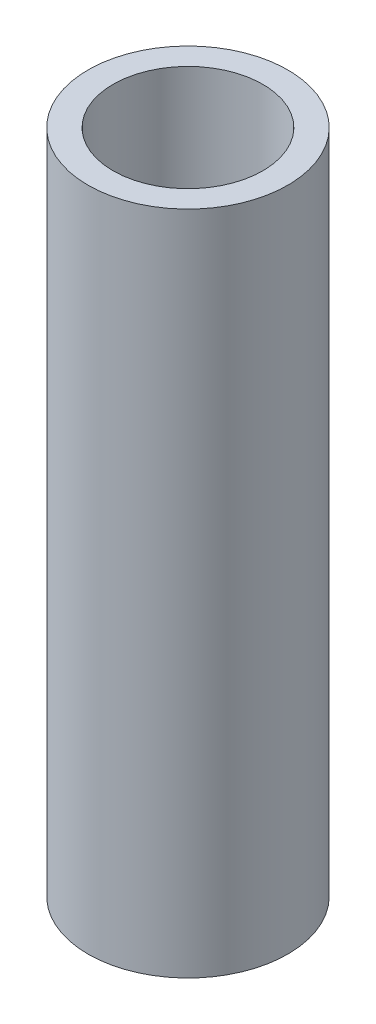
ISO-10303-21;
HEADER;
FILE_DESCRIPTION(('STEP AP214'),'2;1');
FILE_NAME('part.step','',(''),(''),'','','');
FILE_SCHEMA(('AUTOMOTIVE_DESIGN { 1 0 10303 214 1 1 1 1 }'));
ENDSEC;
DATA;
#1=APPLICATION_CONTEXT('core data for automotive mechanical design processes');
#2=APPLICATION_PROTOCOL_DEFINITION('international standard','automotive_design',2000,#1);
#3=PRODUCT_CONTEXT('',#1,'mechanical');
#4=PRODUCT('Part','Part','',(#3));
#5=PRODUCT_RELATED_PRODUCT_CATEGORY('part','',(#4));
#6=PRODUCT_DEFINITION_FORMATION('','',#4);
#7=PRODUCT_DEFINITION_CONTEXT('part definition',#1,'design');
#8=PRODUCT_DEFINITION('design','',#6,#7);
#9=PRODUCT_DEFINITION_SHAPE('','',#8);
#10=(LENGTH_UNIT() NAMED_UNIT(*) SI_UNIT(.MILLI.,.METRE.));
#11=(NAMED_UNIT(*) PLANE_ANGLE_UNIT() SI_UNIT($,.RADIAN.));
#12=(NAMED_UNIT(*) SI_UNIT($,.STERADIAN.) SOLID_ANGLE_UNIT());
#13=UNCERTAINTY_MEASURE_WITH_UNIT(LENGTH_MEASURE(1.E-05),#10,'distance_accuracy_value','');
#14=(GEOMETRIC_REPRESENTATION_CONTEXT(3) GLOBAL_UNCERTAINTY_ASSIGNED_CONTEXT((#13)) GLOBAL_UNIT_ASSIGNED_CONTEXT((#10,
#11,#12)) REPRESENTATION_CONTEXT('',''));
#15=CARTESIAN_POINT('',(0.,0.,0.));
#16=DIRECTION('',(0.,0.,1.));
#17=DIRECTION('',(1.,0.,0.));
#18=AXIS2_PLACEMENT_3D('',#15,#16,#17);
#19=CARTESIAN_POINT('',(0.,40.,0.));
#20=DIRECTION('',(0.,-1.,0.));
#21=DIRECTION('',(0.,0.,-1.));
#22=AXIS2_PLACEMENT_3D('',#19,#20,#21);
#23=CYLINDRICAL_SURFACE('',#22,6.00000000000001);
#24=CARTESIAN_POINT('',(0.,40.,0.));
#25=DIRECTION('',(0.,1.,0.));
#26=DIRECTION('',(0.,0.,1.));
#27=AXIS2_PLACEMENT_3D('',#24,#25,#26);
#28=CIRCLE('',#27,6.00000000000001);
#29=CARTESIAN_POINT('',(0.,40.,6.00000000000001));
#30=VERTEX_POINT('',#29);
#31=EDGE_CURVE('E10',#30,#30,#28,.T.);
#32=ORIENTED_EDGE('',*,*,#31,.F.);
#33=EDGE_LOOP('',(#32));
#34=FACE_BOUND('',#33,.T.);
#35=CARTESIAN_POINT('',(0.,0.,0.));
#36=DIRECTION('',(0.,1.,0.));
#37=DIRECTION('',(0.,0.,1.));
#38=AXIS2_PLACEMENT_3D('',#35,#36,#37);
#39=CIRCLE('',#38,6.00000000000001);
#40=CARTESIAN_POINT('',(0.,0.,6.00000000000001));
#41=VERTEX_POINT('',#40);
#42=EDGE_CURVE('E44',#41,#41,#39,.T.);
#43=ORIENTED_EDGE('',*,*,#42,.T.);
#44=EDGE_LOOP('',(#43));
#45=FACE_BOUND('',#44,.T.);
#46=ADVANCED_FACE('F41',(#34,#45),#23,.T.);
#47=CARTESIAN_POINT('',(0.,40.,0.));
#48=DIRECTION('',(0.,1.,0.));
#49=DIRECTION('',(0.,0.,1.));
#50=AXIS2_PLACEMENT_3D('',#47,#48,#49);
#51=PLANE('',#50);
#52=CARTESIAN_POINT('',(0.,40.,0.));
#53=DIRECTION('',(0.,1.,0.));
#54=DIRECTION('',(0.,0.,1.));
#55=AXIS2_PLACEMENT_3D('',#52,#53,#54);
#56=CIRCLE('',#55,4.5);
#57=CARTESIAN_POINT('',(0.,40.,4.5));
#58=VERTEX_POINT('',#57);
#59=EDGE_CURVE('E53',#58,#58,#56,.T.);
#60=ORIENTED_EDGE('',*,*,#59,.F.);
#61=EDGE_LOOP('',(#60));
#62=FACE_BOUND('',#61,.T.);
#63=ORIENTED_EDGE('',*,*,#31,.T.);
#64=EDGE_LOOP('',(#63));
#65=FACE_BOUND('',#64,.T.);
#66=ADVANCED_FACE('F68',(#62,#65),#51,.T.);
#67=CARTESIAN_POINT('',(0.,0.,0.));
#68=DIRECTION('',(0.,1.,0.));
#69=DIRECTION('',(0.,0.,1.));
#70=AXIS2_PLACEMENT_3D('',#67,#68,#69);
#71=PLANE('',#70);
#72=ORIENTED_EDGE('',*,*,#42,.F.);
#73=EDGE_LOOP('',(#72));
#74=FACE_BOUND('',#73,.T.);
#75=ADVANCED_FACE('F64',(#74),#71,.F.);
#76=CARTESIAN_POINT('',(0.,2.,0.));
#77=DIRECTION('',(0.,1.,0.));
#78=DIRECTION('',(0.,0.,1.));
#79=AXIS2_PLACEMENT_3D('',#76,#77,#78);
#80=CYLINDRICAL_SURFACE('',#79,4.5);
#81=CARTESIAN_POINT('',(0.,2.,0.));
#82=DIRECTION('',(0.,1.,0.));
#83=DIRECTION('',(0.,0.,1.));
#84=AXIS2_PLACEMENT_3D('',#81,#82,#83);
#85=CIRCLE('',#84,4.5);
#86=CARTESIAN_POINT('',(0.,2.,4.5));
#87=VERTEX_POINT('',#86);
#88=EDGE_CURVE('E51',#87,#87,#85,.T.);
#89=ORIENTED_EDGE('',*,*,#88,.F.);
#90=EDGE_LOOP('',(#89));
#91=FACE_BOUND('',#90,.T.);
#92=ORIENTED_EDGE('',*,*,#59,.T.);
#93=EDGE_LOOP('',(#92));
#94=FACE_BOUND('',#93,.T.);
#95=ADVANCED_FACE('F61',(#91,#94),#80,.F.);
#96=CARTESIAN_POINT('',(0.,2.,0.));
#97=DIRECTION('',(0.,1.,0.));
#98=DIRECTION('',(0.,0.,1.));
#99=AXIS2_PLACEMENT_3D('',#96,#97,#98);
#100=PLANE('',#99);
#101=ORIENTED_EDGE('',*,*,#88,.T.);
#102=EDGE_LOOP('',(#101));
#103=FACE_BOUND('',#102,.T.);
#104=ADVANCED_FACE('F59',(#103),#100,.T.);
#105=CLOSED_SHELL('',(#46,#66,#75,#95,#104));
#106=MANIFOLD_SOLID_BREP('B2',#105);
#107=ADVANCED_BREP_SHAPE_REPRESENTATION('',(#18,#106),#14);
#108=SHAPE_DEFINITION_REPRESENTATION(#9,#107);
ENDSEC;
END-ISO-10303-21;
